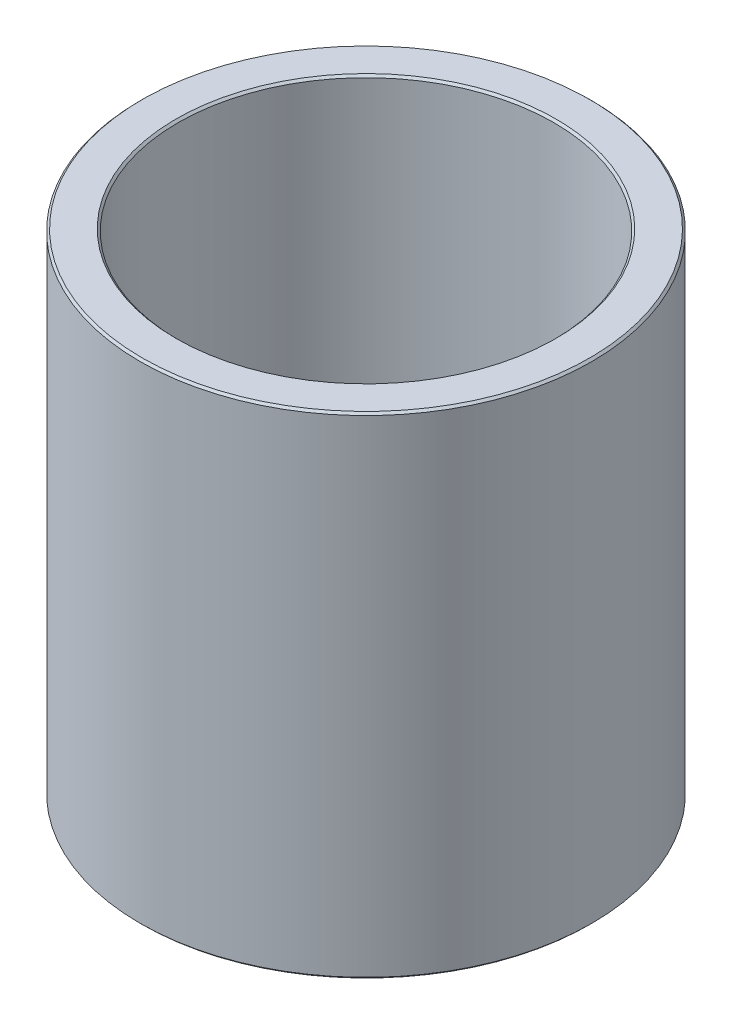
ISO-10303-21;
HEADER;
FILE_DESCRIPTION(('STEP AP214'),'2;1');
FILE_NAME('part.step','',(''),(''),'','','');
FILE_SCHEMA(('AUTOMOTIVE_DESIGN { 1 0 10303 214 1 1 1 1 }'));
ENDSEC;
DATA;
#1=APPLICATION_CONTEXT('core data for automotive mechanical design processes');
#2=APPLICATION_PROTOCOL_DEFINITION('international standard','automotive_design',2000,#1);
#3=PRODUCT_CONTEXT('',#1,'mechanical');
#4=PRODUCT('Part','Part','',(#3));
#5=PRODUCT_RELATED_PRODUCT_CATEGORY('part','',(#4));
#6=PRODUCT_DEFINITION_FORMATION('','',#4);
#7=PRODUCT_DEFINITION_CONTEXT('part definition',#1,'design');
#8=PRODUCT_DEFINITION('design','',#6,#7);
#9=PRODUCT_DEFINITION_SHAPE('','',#8);
#10=(LENGTH_UNIT() NAMED_UNIT(*) SI_UNIT(.MILLI.,.METRE.));
#11=(NAMED_UNIT(*) PLANE_ANGLE_UNIT() SI_UNIT($,.RADIAN.));
#12=(NAMED_UNIT(*) SI_UNIT($,.STERADIAN.) SOLID_ANGLE_UNIT());
#13=UNCERTAINTY_MEASURE_WITH_UNIT(LENGTH_MEASURE(1.E-05),#10,'distance_accuracy_value','');
#14=(GEOMETRIC_REPRESENTATION_CONTEXT(3) GLOBAL_UNCERTAINTY_ASSIGNED_CONTEXT((#13)) GLOBAL_UNIT_ASSIGNED_CONTEXT((#10,
#11,#12)) REPRESENTATION_CONTEXT('',''));
#15=CARTESIAN_POINT('',(0.,0.,0.));
#16=DIRECTION('',(0.,0.,1.));
#17=DIRECTION('',(1.,0.,0.));
#18=AXIS2_PLACEMENT_3D('',#15,#16,#17);
#19=CARTESIAN_POINT('',(0.,97.7543440762183,0.));
#20=DIRECTION('',(0.,-1.,0.));
#21=DIRECTION('',(0.,0.,-1.));
#22=AXIS2_PLACEMENT_3D('',#19,#20,#21);
#23=CYLINDRICAL_SURFACE('',#22,45.);
#24=CARTESIAN_POINT('',(0.,0.418461382077406,0.));
#25=DIRECTION('',(0.,1.,0.));
#26=DIRECTION('',(0.,0.,1.));
#27=AXIS2_PLACEMENT_3D('',#24,#25,#26);
#28=CIRCLE('',#27,45.);
#29=CARTESIAN_POINT('',(0.,0.418461382077406,45.));
#30=VERTEX_POINT('',#29);
#31=EDGE_CURVE('E10',#30,#30,#28,.T.);
#32=ORIENTED_EDGE('',*,*,#31,.T.);
#33=EDGE_LOOP('',(#32));
#34=FACE_BOUND('',#33,.T.);
#35=CARTESIAN_POINT('',(0.,97.3358826941409,0.));
#36=DIRECTION('',(0.,1.,0.));
#37=DIRECTION('',(0.,0.,1.));
#38=AXIS2_PLACEMENT_3D('',#35,#36,#37);
#39=CIRCLE('',#38,45.);
#40=CARTESIAN_POINT('',(0.,97.3358826941409,45.));
#41=VERTEX_POINT('',#40);
#42=EDGE_CURVE('E50',#41,#41,#39,.F.);
#43=ORIENTED_EDGE('',*,*,#42,.T.);
#44=EDGE_LOOP('',(#43));
#45=FACE_BOUND('',#44,.T.);
#46=ADVANCED_FACE('F39',(#34,#45),#23,.T.);
#47=CARTESIAN_POINT('',(0.,97.7543440762183,0.));
#48=DIRECTION('',(0.,1.,0.));
#49=DIRECTION('',(0.,0.,1.));
#50=AXIS2_PLACEMENT_3D('',#47,#48,#49);
#51=PLANE('',#50);
#52=CARTESIAN_POINT('',(0.,97.7543440762183,0.));
#53=DIRECTION('',(0.,1.,0.));
#54=DIRECTION('',(0.,0.,1.));
#55=AXIS2_PLACEMENT_3D('',#52,#53,#54);
#56=CIRCLE('',#55,37.8589851912015);
#57=CARTESIAN_POINT('',(0.,97.7543440762183,37.8589851912015));
#58=VERTEX_POINT('',#57);
#59=EDGE_CURVE('E58',#58,#58,#56,.F.);
#60=ORIENTED_EDGE('',*,*,#59,.T.);
#61=EDGE_LOOP('',(#60));
#62=FACE_BOUND('',#61,.T.);
#63=CARTESIAN_POINT('',(0.,97.7543440762183,0.));
#64=DIRECTION('',(0.,1.,0.));
#65=DIRECTION('',(0.,0.,1.));
#66=AXIS2_PLACEMENT_3D('',#63,#64,#65);
#67=CIRCLE('',#66,44.5815386179226);
#68=CARTESIAN_POINT('',(0.,97.7543440762183,44.5815386179226));
#69=VERTEX_POINT('',#68);
#70=EDGE_CURVE('E61',#69,#69,#67,.T.);
#71=ORIENTED_EDGE('',*,*,#70,.T.);
#72=EDGE_LOOP('',(#71));
#73=FACE_BOUND('',#72,.T.);
#74=ADVANCED_FACE('F88',(#62,#73),#51,.T.);
#75=CARTESIAN_POINT('',(0.,0.,0.));
#76=DIRECTION('',(0.,1.,0.));
#77=DIRECTION('',(0.,0.,1.));
#78=AXIS2_PLACEMENT_3D('',#75,#76,#77);
#79=PLANE('',#78);
#80=CARTESIAN_POINT('',(0.,0.,0.));
#81=DIRECTION('',(0.,1.,0.));
#82=DIRECTION('',(0.,0.,1.));
#83=AXIS2_PLACEMENT_3D('',#80,#81,#82);
#84=CIRCLE('',#83,37.8589851912015);
#85=CARTESIAN_POINT('',(0.,0.,37.8589851912015));
#86=VERTEX_POINT('',#85);
#87=EDGE_CURVE('E51',#86,#86,#84,.T.);
#88=ORIENTED_EDGE('',*,*,#87,.T.);
#89=EDGE_LOOP('',(#88));
#90=FACE_BOUND('',#89,.T.);
#91=CARTESIAN_POINT('',(0.,0.,0.));
#92=DIRECTION('',(0.,1.,0.));
#93=DIRECTION('',(0.,0.,1.));
#94=AXIS2_PLACEMENT_3D('',#91,#92,#93);
#95=CIRCLE('',#94,44.5815386179226);
#96=CARTESIAN_POINT('',(0.,0.,44.5815386179226));
#97=VERTEX_POINT('',#96);
#98=EDGE_CURVE('E54',#97,#97,#95,.F.);
#99=ORIENTED_EDGE('',*,*,#98,.T.);
#100=EDGE_LOOP('',(#99));
#101=FACE_BOUND('',#100,.T.);
#102=ADVANCED_FACE('F83',(#90,#101),#79,.F.);
#103=CARTESIAN_POINT('',(0.,97.7543440762183,0.));
#104=DIRECTION('',(0.,-1.,0.));
#105=DIRECTION('',(0.,0.,-1.));
#106=AXIS2_PLACEMENT_3D('',#103,#104,#105);
#107=CYLINDRICAL_SURFACE('',#106,37.4405238091241);
#108=CARTESIAN_POINT('',(0.,97.335882694141,0.));
#109=DIRECTION('',(0.,1.,0.));
#110=DIRECTION('',(0.,0.,1.));
#111=AXIS2_PLACEMENT_3D('',#108,#109,#110);
#112=CIRCLE('',#111,37.4405238091241);
#113=CARTESIAN_POINT('',(0.,97.335882694141,37.4405238091241));
#114=VERTEX_POINT('',#113);
#115=EDGE_CURVE('E67',#114,#114,#112,.T.);
#116=ORIENTED_EDGE('',*,*,#115,.T.);
#117=EDGE_LOOP('',(#116));
#118=FACE_BOUND('',#117,.T.);
#119=CARTESIAN_POINT('',(0.,0.418461382077434,0.));
#120=DIRECTION('',(0.,1.,0.));
#121=DIRECTION('',(0.,0.,1.));
#122=AXIS2_PLACEMENT_3D('',#119,#120,#121);
#123=CIRCLE('',#122,37.4405238091241);
#124=CARTESIAN_POINT('',(0.,0.418461382077434,37.4405238091241));
#125=VERTEX_POINT('',#124);
#126=EDGE_CURVE('E69',#125,#125,#123,.F.);
#127=ORIENTED_EDGE('',*,*,#126,.T.);
#128=EDGE_LOOP('',(#127));
#129=FACE_BOUND('',#128,.T.);
#130=ADVANCED_FACE('F71',(#118,#129),#107,.F.);
#131=CARTESIAN_POINT('',(0.,97.335882694141,0.));
#132=DIRECTION('',(0.,1.,0.));
#133=DIRECTION('',(0.,0.,1.));
#134=AXIS2_PLACEMENT_3D('',#131,#132,#133);
#135=CONICAL_SURFACE('',#134,37.4405238091241,0.785398163397448);
#136=ORIENTED_EDGE('',*,*,#59,.F.);
#137=EDGE_LOOP('',(#136));
#138=FACE_BOUND('',#137,.T.);
#139=ORIENTED_EDGE('',*,*,#115,.F.);
#140=EDGE_LOOP('',(#139));
#141=FACE_BOUND('',#140,.T.);
#142=ADVANCED_FACE('F77',(#138,#141),#135,.F.);
#143=CARTESIAN_POINT('',(0.,0.,0.));
#144=DIRECTION('',(0.,-1.,0.));
#145=DIRECTION('',(0.,0.,-1.));
#146=AXIS2_PLACEMENT_3D('',#143,#144,#145);
#147=CONICAL_SURFACE('',#146,37.8589851912015,0.785398163397448);
#148=ORIENTED_EDGE('',*,*,#126,.F.);
#149=EDGE_LOOP('',(#148));
#150=FACE_BOUND('',#149,.T.);
#151=ORIENTED_EDGE('',*,*,#87,.F.);
#152=EDGE_LOOP('',(#151));
#153=FACE_BOUND('',#152,.T.);
#154=ADVANCED_FACE('F73',(#150,#153),#147,.F.);
#155=CARTESIAN_POINT('',(0.,0.418461382077406,0.));
#156=DIRECTION('',(0.,1.,0.));
#157=DIRECTION('',(0.,0.,1.));
#158=AXIS2_PLACEMENT_3D('',#155,#156,#157);
#159=CONICAL_SURFACE('',#158,45.,0.785398163397465);
#160=ORIENTED_EDGE('',*,*,#98,.F.);
#161=EDGE_LOOP('',(#160));
#162=FACE_BOUND('',#161,.T.);
#163=ORIENTED_EDGE('',*,*,#31,.F.);
#164=EDGE_LOOP('',(#163));
#165=FACE_BOUND('',#164,.T.);
#166=ADVANCED_FACE('F76',(#162,#165),#159,.T.);
#167=CARTESIAN_POINT('',(0.,97.7543440762183,0.));
#168=DIRECTION('',(0.,-1.,0.));
#169=DIRECTION('',(0.,0.,-1.));
#170=AXIS2_PLACEMENT_3D('',#167,#168,#169);
#171=CONICAL_SURFACE('',#170,44.5815386179226,0.785398163397407);
#172=ORIENTED_EDGE('',*,*,#42,.F.);
#173=EDGE_LOOP('',(#172));
#174=FACE_BOUND('',#173,.T.);
#175=ORIENTED_EDGE('',*,*,#70,.F.);
#176=EDGE_LOOP('',(#175));
#177=FACE_BOUND('',#176,.T.);
#178=ADVANCED_FACE('F45',(#174,#177),#171,.T.);
#179=CLOSED_SHELL('',(#46,#74,#102,#130,#142,#154,#166,#178));
#180=MANIFOLD_SOLID_BREP('B2',#179);
#181=ADVANCED_BREP_SHAPE_REPRESENTATION('',(#18,#180),#14);
#182=SHAPE_DEFINITION_REPRESENTATION(#9,#181);
ENDSEC;
END-ISO-10303-21;
